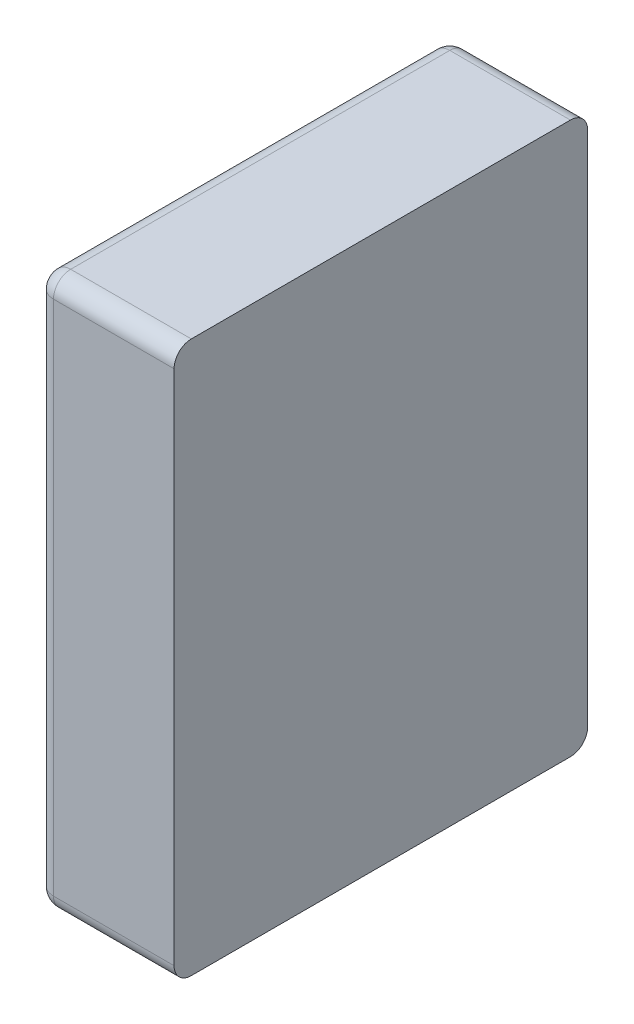
ISO-10303-21;
HEADER;
FILE_DESCRIPTION(('STEP AP214'),'2;1');
FILE_NAME('part.step','',(''),(''),'','','');
FILE_SCHEMA(('AUTOMOTIVE_DESIGN { 1 0 10303 214 1 1 1 1 }'));
ENDSEC;
DATA;
#1=APPLICATION_CONTEXT('core data for automotive mechanical design processes');
#2=APPLICATION_PROTOCOL_DEFINITION('international standard','automotive_design',2000,#1);
#3=PRODUCT_CONTEXT('',#1,'mechanical');
#4=PRODUCT('Part','Part','',(#3));
#5=PRODUCT_RELATED_PRODUCT_CATEGORY('part','',(#4));
#6=PRODUCT_DEFINITION_FORMATION('','',#4);
#7=PRODUCT_DEFINITION_CONTEXT('part definition',#1,'design');
#8=PRODUCT_DEFINITION('design','',#6,#7);
#9=PRODUCT_DEFINITION_SHAPE('','',#8);
#10=(LENGTH_UNIT() NAMED_UNIT(*) SI_UNIT(.MILLI.,.METRE.));
#11=(NAMED_UNIT(*) PLANE_ANGLE_UNIT() SI_UNIT($,.RADIAN.));
#12=(NAMED_UNIT(*) SI_UNIT($,.STERADIAN.) SOLID_ANGLE_UNIT());
#13=UNCERTAINTY_MEASURE_WITH_UNIT(LENGTH_MEASURE(1.E-05),#10,'distance_accuracy_value','');
#14=(GEOMETRIC_REPRESENTATION_CONTEXT(3) GLOBAL_UNCERTAINTY_ASSIGNED_CONTEXT((#13)) GLOBAL_UNIT_ASSIGNED_CONTEXT((#10,
#11,#12)) REPRESENTATION_CONTEXT('',''));
#15=CARTESIAN_POINT('',(0.,0.,0.));
#16=DIRECTION('',(0.,0.,1.));
#17=DIRECTION('',(1.,0.,0.));
#18=AXIS2_PLACEMENT_3D('',#15,#16,#17);
#19=CARTESIAN_POINT('',(-0.8,-0.4,0.3));
#20=DIRECTION('',(1.,0.,0.));
#21=DIRECTION('',(0.,0.,-1.));
#22=AXIS2_PLACEMENT_3D('',#19,#20,#21);
#23=PLANE('',#22);
#24=DIRECTION('',(0.,0.,1.));
#25=VECTOR('',#24,1.);
#26=CARTESIAN_POINT('',(-0.8,0.375,0.3));
#27=LINE('',#26,#25);
#28=CARTESIAN_POINT('',(-0.8,0.375,0.025));
#29=VERTEX_POINT('',#28);
#30=CARTESIAN_POINT('',(-0.8,0.375,0.575));
#31=VERTEX_POINT('',#30);
#32=EDGE_CURVE('E106',#29,#31,#27,.T.);
#33=ORIENTED_EDGE('',*,*,#32,.F.);
#34=DIRECTION('',(0.,-1.,0.));
#35=VECTOR('',#34,1.);
#36=CARTESIAN_POINT('',(-0.8,-0.4,0.025));
#37=LINE('',#36,#35);
#38=CARTESIAN_POINT('',(-0.8,-0.375,0.025));
#39=VERTEX_POINT('',#38);
#40=EDGE_CURVE('E101',#39,#29,#37,.F.);
#41=ORIENTED_EDGE('',*,*,#40,.F.);
#42=DIRECTION('',(0.,0.,-1.));
#43=VECTOR('',#42,1.);
#44=CARTESIAN_POINT('',(-0.8,-0.375,0.3));
#45=LINE('',#44,#43);
#46=CARTESIAN_POINT('',(-0.8,-0.375,0.575));
#47=VERTEX_POINT('',#46);
#48=EDGE_CURVE('E104',#47,#39,#45,.T.);
#49=ORIENTED_EDGE('',*,*,#48,.F.);
#50=DIRECTION('',(0.,-1.,0.));
#51=VECTOR('',#50,1.);
#52=CARTESIAN_POINT('',(-0.8,-0.4,0.575));
#53=LINE('',#52,#51);
#54=EDGE_CURVE('E166',#31,#47,#53,.T.);
#55=ORIENTED_EDGE('',*,*,#54,.F.);
#56=EDGE_LOOP('',(#33,#41,#49,#55));
#57=FACE_BOUND('',#56,.T.);
#58=ADVANCED_FACE('F17',(#57),#23,.F.);
#59=CARTESIAN_POINT('',(-0.775,0.375,0.025));
#60=DIRECTION('',(1.,0.,0.));
#61=DIRECTION('',(0.,1.,0.));
#62=AXIS2_PLACEMENT_3D('',#59,#60,#61);
#63=SPHERICAL_SURFACE('',#62,0.025);
#64=CARTESIAN_POINT('',(-0.775,0.375,0.025));
#65=DIRECTION('',(0.,-1.,0.));
#66=DIRECTION('',(0.,0.,-1.));
#67=AXIS2_PLACEMENT_3D('',#64,#65,#66);
#68=CIRCLE('',#67,0.025);
#69=CARTESIAN_POINT('',(-0.775,0.375,0.));
#70=VERTEX_POINT('',#69);
#71=EDGE_CURVE('E109',#29,#70,#68,.T.);
#72=ORIENTED_EDGE('',*,*,#71,.F.);
#73=CARTESIAN_POINT('',(-0.775,0.375,0.025));
#74=DIRECTION('',(0.,0.,1.));
#75=DIRECTION('',(1.,0.,0.));
#76=AXIS2_PLACEMENT_3D('',#73,#74,#75);
#77=CIRCLE('',#76,0.025);
#78=CARTESIAN_POINT('',(-0.775,0.4,0.025));
#79=VERTEX_POINT('',#78);
#80=EDGE_CURVE('E163',#79,#29,#77,.T.);
#81=ORIENTED_EDGE('',*,*,#80,.F.);
#82=CARTESIAN_POINT('',(-0.775,0.375,0.025));
#83=DIRECTION('',(-1.,0.,0.));
#84=DIRECTION('',(0.,0.,1.));
#85=AXIS2_PLACEMENT_3D('',#82,#83,#84);
#86=CIRCLE('',#85,0.025);
#87=EDGE_CURVE('E162',#70,#79,#86,.F.);
#88=ORIENTED_EDGE('',*,*,#87,.F.);
#89=EDGE_LOOP('',(#72,#81,#88));
#90=FACE_BOUND('',#89,.T.);
#91=ADVANCED_FACE('F152',(#90),#63,.T.);
#92=CARTESIAN_POINT('',(-0.775,-0.4,0.025));
#93=DIRECTION('',(0.,-1.,0.));
#94=DIRECTION('',(0.,0.,-1.));
#95=AXIS2_PLACEMENT_3D('',#92,#93,#94);
#96=CYLINDRICAL_SURFACE('',#95,0.025);
#97=ORIENTED_EDGE('',*,*,#71,.T.);
#98=DIRECTION('',(0.,1.,0.));
#99=VECTOR('',#98,1.);
#100=CARTESIAN_POINT('',(-0.775,-0.4,0.));
#101=LINE('',#100,#99);
#102=CARTESIAN_POINT('',(-0.775,-0.375,0.));
#103=VERTEX_POINT('',#102);
#104=EDGE_CURVE('E115',#70,#103,#101,.F.);
#105=ORIENTED_EDGE('',*,*,#104,.T.);
#106=CARTESIAN_POINT('',(-0.775,-0.375,0.025));
#107=DIRECTION('',(0.,1.,0.));
#108=DIRECTION('',(1.,0.,0.));
#109=AXIS2_PLACEMENT_3D('',#106,#107,#108);
#110=CIRCLE('',#109,0.025);
#111=EDGE_CURVE('E112',#39,#103,#110,.F.);
#112=ORIENTED_EDGE('',*,*,#111,.F.);
#113=ORIENTED_EDGE('',*,*,#40,.T.);
#114=EDGE_LOOP('',(#97,#105,#112,#113));
#115=FACE_BOUND('',#114,.T.);
#116=ADVANCED_FACE('F113',(#115),#96,.T.);
#117=CARTESIAN_POINT('',(-0.775,-0.375,0.025));
#118=DIRECTION('',(1.,0.,0.));
#119=DIRECTION('',(0.,1.,0.));
#120=AXIS2_PLACEMENT_3D('',#117,#118,#119);
#121=SPHERICAL_SURFACE('',#120,0.025);
#122=CARTESIAN_POINT('',(-0.775,-0.375,0.025));
#123=DIRECTION('',(0.,0.,-1.));
#124=DIRECTION('',(-1.,0.,0.));
#125=AXIS2_PLACEMENT_3D('',#122,#123,#124);
#126=CIRCLE('',#125,0.025);
#127=CARTESIAN_POINT('',(-0.775,-0.4,0.025));
#128=VERTEX_POINT('',#127);
#129=EDGE_CURVE('E121',#39,#128,#126,.F.);
#130=ORIENTED_EDGE('',*,*,#129,.F.);
#131=ORIENTED_EDGE('',*,*,#111,.T.);
#132=CARTESIAN_POINT('',(-0.775,-0.375,0.025));
#133=DIRECTION('',(1.,0.,0.));
#134=DIRECTION('',(0.,0.,-1.));
#135=AXIS2_PLACEMENT_3D('',#132,#133,#134);
#136=CIRCLE('',#135,0.025);
#137=EDGE_CURVE('E131',#128,#103,#136,.T.);
#138=ORIENTED_EDGE('',*,*,#137,.F.);
#139=EDGE_LOOP('',(#130,#131,#138));
#140=FACE_BOUND('',#139,.T.);
#141=ADVANCED_FACE('F130',(#140),#121,.T.);
#142=CARTESIAN_POINT('',(-0.775,-0.375,0.3));
#143=DIRECTION('',(0.,0.,-1.));
#144=DIRECTION('',(-1.,0.,0.));
#145=AXIS2_PLACEMENT_3D('',#142,#143,#144);
#146=CYLINDRICAL_SURFACE('',#145,0.025);
#147=CARTESIAN_POINT('',(-0.775,-0.375,0.575));
#148=DIRECTION('',(0.,0.,-1.));
#149=DIRECTION('',(1.,0.,0.));
#150=AXIS2_PLACEMENT_3D('',#147,#148,#149);
#151=CIRCLE('',#150,0.025);
#152=CARTESIAN_POINT('',(-0.775,-0.4,0.575));
#153=VERTEX_POINT('',#152);
#154=EDGE_CURVE('E127',#47,#153,#151,.F.);
#155=ORIENTED_EDGE('',*,*,#154,.F.);
#156=ORIENTED_EDGE('',*,*,#48,.T.);
#157=ORIENTED_EDGE('',*,*,#129,.T.);
#158=DIRECTION('',(0.,0.,-1.));
#159=VECTOR('',#158,1.);
#160=CARTESIAN_POINT('',(-0.775,-0.4,0.3));
#161=LINE('',#160,#159);
#162=EDGE_CURVE('E220',#153,#128,#161,.T.);
#163=ORIENTED_EDGE('',*,*,#162,.F.);
#164=EDGE_LOOP('',(#155,#156,#157,#163));
#165=FACE_BOUND('',#164,.T.);
#166=ADVANCED_FACE('F124',(#165),#146,.T.);
#167=CARTESIAN_POINT('',(-0.775,-0.375,0.575));
#168=DIRECTION('',(1.,0.,0.));
#169=DIRECTION('',(0.,1.,0.));
#170=AXIS2_PLACEMENT_3D('',#167,#168,#169);
#171=SPHERICAL_SURFACE('',#170,0.025);
#172=CARTESIAN_POINT('',(-0.775,-0.375,0.575));
#173=DIRECTION('',(-1.,0.,0.));
#174=DIRECTION('',(0.,0.,1.));
#175=AXIS2_PLACEMENT_3D('',#172,#173,#174);
#176=CIRCLE('',#175,0.025);
#177=CARTESIAN_POINT('',(-0.775,-0.375,0.6));
#178=VERTEX_POINT('',#177);
#179=EDGE_CURVE('E215',#178,#153,#176,.F.);
#180=ORIENTED_EDGE('',*,*,#179,.F.);
#181=CARTESIAN_POINT('',(-0.775,-0.375,0.575));
#182=DIRECTION('',(0.,-1.,0.));
#183=DIRECTION('',(0.,0.,-1.));
#184=AXIS2_PLACEMENT_3D('',#181,#182,#183);
#185=CIRCLE('',#184,0.025);
#186=EDGE_CURVE('E169',#47,#178,#185,.F.);
#187=ORIENTED_EDGE('',*,*,#186,.F.);
#188=ORIENTED_EDGE('',*,*,#154,.T.);
#189=EDGE_LOOP('',(#180,#187,#188));
#190=FACE_BOUND('',#189,.T.);
#191=ADVANCED_FACE('F264',(#190),#171,.T.);
#192=CARTESIAN_POINT('',(-0.775,-0.4,0.575));
#193=DIRECTION('',(0.,-1.,0.));
#194=DIRECTION('',(0.,0.,-1.));
#195=AXIS2_PLACEMENT_3D('',#192,#193,#194);
#196=CYLINDRICAL_SURFACE('',#195,0.025);
#197=CARTESIAN_POINT('',(-0.775,0.375,0.575));
#198=DIRECTION('',(0.,-1.,0.));
#199=DIRECTION('',(1.,0.,0.));
#200=AXIS2_PLACEMENT_3D('',#197,#198,#199);
#201=CIRCLE('',#200,0.025);
#202=CARTESIAN_POINT('',(-0.775,0.375,0.6));
#203=VERTEX_POINT('',#202);
#204=EDGE_CURVE('E168',#31,#203,#201,.F.);
#205=ORIENTED_EDGE('',*,*,#204,.F.);
#206=ORIENTED_EDGE('',*,*,#54,.T.);
#207=ORIENTED_EDGE('',*,*,#186,.T.);
#208=DIRECTION('',(0.,1.,0.));
#209=VECTOR('',#208,1.);
#210=CARTESIAN_POINT('',(-0.775,-0.4,0.6));
#211=LINE('',#210,#209);
#212=EDGE_CURVE('E210',#178,#203,#211,.T.);
#213=ORIENTED_EDGE('',*,*,#212,.T.);
#214=EDGE_LOOP('',(#205,#206,#207,#213));
#215=FACE_BOUND('',#214,.T.);
#216=ADVANCED_FACE('F260',(#215),#196,.T.);
#217=CARTESIAN_POINT('',(-0.775,0.375,0.575));
#218=DIRECTION('',(1.,0.,0.));
#219=DIRECTION('',(0.,1.,0.));
#220=AXIS2_PLACEMENT_3D('',#217,#218,#219);
#221=SPHERICAL_SURFACE('',#220,0.025);
#222=CARTESIAN_POINT('',(-0.775,0.375,0.575));
#223=DIRECTION('',(1.,0.,0.));
#224=DIRECTION('',(0.,0.,-1.));
#225=AXIS2_PLACEMENT_3D('',#222,#223,#224);
#226=CIRCLE('',#225,0.025);
#227=CARTESIAN_POINT('',(-0.775,0.4,0.575));
#228=VERTEX_POINT('',#227);
#229=EDGE_CURVE('E204',#228,#203,#226,.T.);
#230=ORIENTED_EDGE('',*,*,#229,.F.);
#231=CARTESIAN_POINT('',(-0.775,0.375,0.575));
#232=DIRECTION('',(0.,0.,1.));
#233=DIRECTION('',(1.,0.,0.));
#234=AXIS2_PLACEMENT_3D('',#231,#232,#233);
#235=CIRCLE('',#234,0.025);
#236=EDGE_CURVE('E66',#31,#228,#235,.F.);
#237=ORIENTED_EDGE('',*,*,#236,.F.);
#238=ORIENTED_EDGE('',*,*,#204,.T.);
#239=EDGE_LOOP('',(#230,#237,#238));
#240=FACE_BOUND('',#239,.T.);
#241=ADVANCED_FACE('F255',(#240),#221,.T.);
#242=CARTESIAN_POINT('',(-0.775,0.375,0.3));
#243=DIRECTION('',(0.,0.,1.));
#244=DIRECTION('',(1.,0.,0.));
#245=AXIS2_PLACEMENT_3D('',#242,#243,#244);
#246=CYLINDRICAL_SURFACE('',#245,0.025);
#247=ORIENTED_EDGE('',*,*,#80,.T.);
#248=ORIENTED_EDGE('',*,*,#32,.T.);
#249=ORIENTED_EDGE('',*,*,#236,.T.);
#250=DIRECTION('',(0.,0.,-1.));
#251=VECTOR('',#250,1.);
#252=CARTESIAN_POINT('',(-0.775,0.4,0.3));
#253=LINE('',#252,#251);
#254=EDGE_CURVE('E192',#228,#79,#253,.T.);
#255=ORIENTED_EDGE('',*,*,#254,.T.);
#256=EDGE_LOOP('',(#247,#248,#249,#255));
#257=FACE_BOUND('',#256,.T.);
#258=ADVANCED_FACE('F259',(#257),#246,.T.);
#259=CARTESIAN_POINT('',(-0.7,0.375,0.025));
#260=DIRECTION('',(-1.,0.,0.));
#261=DIRECTION('',(0.,0.,1.));
#262=AXIS2_PLACEMENT_3D('',#259,#260,#261);
#263=CYLINDRICAL_SURFACE('',#262,0.025);
#264=ORIENTED_EDGE('',*,*,#87,.T.);
#265=DIRECTION('',(1.,0.,0.));
#266=VECTOR('',#265,1.);
#267=CARTESIAN_POINT('',(-0.4,0.4,0.025));
#268=LINE('',#267,#266);
#269=CARTESIAN_POINT('',(-0.6,0.4,0.025));
#270=VERTEX_POINT('',#269);
#271=EDGE_CURVE('E196',#79,#270,#268,.T.);
#272=ORIENTED_EDGE('',*,*,#271,.T.);
#273=CARTESIAN_POINT('',(-0.6,0.375,0.025));
#274=DIRECTION('',(-1.,0.,0.));
#275=DIRECTION('',(0.,0.,1.));
#276=AXIS2_PLACEMENT_3D('',#273,#274,#275);
#277=CIRCLE('',#276,0.025);
#278=CARTESIAN_POINT('',(-0.6,0.375,0.));
#279=VERTEX_POINT('',#278);
#280=EDGE_CURVE('E20',#270,#279,#277,.T.);
#281=ORIENTED_EDGE('',*,*,#280,.T.);
#282=DIRECTION('',(1.,0.,0.));
#283=VECTOR('',#282,1.);
#284=CARTESIAN_POINT('',(-0.7,0.375,0.));
#285=LINE('',#284,#283);
#286=EDGE_CURVE('E141',#279,#70,#285,.F.);
#287=ORIENTED_EDGE('',*,*,#286,.T.);
#288=EDGE_LOOP('',(#264,#272,#281,#287));
#289=FACE_BOUND('',#288,.T.);
#290=ADVANCED_FACE('F371',(#289),#263,.T.);
#291=CARTESIAN_POINT('',(-0.7,-0.4,0.));
#292=DIRECTION('',(0.,0.,1.));
#293=DIRECTION('',(1.,0.,0.));
#294=AXIS2_PLACEMENT_3D('',#291,#292,#293);
#295=PLANE('',#294);
#296=ORIENTED_EDGE('',*,*,#286,.F.);
#297=DIRECTION('',(0.,1.,0.));
#298=VECTOR('',#297,1.);
#299=CARTESIAN_POINT('',(-0.6,-0.4,0.));
#300=LINE('',#299,#298);
#301=CARTESIAN_POINT('',(-0.6,-0.375,0.));
#302=VERTEX_POINT('',#301);
#303=EDGE_CURVE('E184',#279,#302,#300,.F.);
#304=ORIENTED_EDGE('',*,*,#303,.T.);
#305=DIRECTION('',(1.,0.,0.));
#306=VECTOR('',#305,1.);
#307=CARTESIAN_POINT('',(-0.4,-0.375,0.));
#308=LINE('',#307,#306);
#309=EDGE_CURVE('E223',#103,#302,#308,.T.);
#310=ORIENTED_EDGE('',*,*,#309,.F.);
#311=ORIENTED_EDGE('',*,*,#104,.F.);
#312=EDGE_LOOP('',(#296,#304,#310,#311));
#313=FACE_BOUND('',#312,.T.);
#314=ADVANCED_FACE('F362',(#313),#295,.F.);
#315=CARTESIAN_POINT('',(-0.4,-0.375,0.025));
#316=DIRECTION('',(1.,0.,0.));
#317=DIRECTION('',(0.,0.,-1.));
#318=AXIS2_PLACEMENT_3D('',#315,#316,#317);
#319=CYLINDRICAL_SURFACE('',#318,0.025);
#320=ORIENTED_EDGE('',*,*,#137,.T.);
#321=ORIENTED_EDGE('',*,*,#309,.T.);
#322=CARTESIAN_POINT('',(-0.6,-0.375,0.025));
#323=DIRECTION('',(1.,0.,0.));
#324=DIRECTION('',(0.,0.,-1.));
#325=AXIS2_PLACEMENT_3D('',#322,#323,#324);
#326=CIRCLE('',#325,0.025);
#327=CARTESIAN_POINT('',(-0.6,-0.4,0.025));
#328=VERTEX_POINT('',#327);
#329=EDGE_CURVE('E182',#302,#328,#326,.F.);
#330=ORIENTED_EDGE('',*,*,#329,.T.);
#331=DIRECTION('',(1.,0.,0.));
#332=VECTOR('',#331,1.);
#333=CARTESIAN_POINT('',(-0.4,-0.4,0.025));
#334=LINE('',#333,#332);
#335=EDGE_CURVE('E218',#128,#328,#334,.T.);
#336=ORIENTED_EDGE('',*,*,#335,.F.);
#337=EDGE_LOOP('',(#320,#321,#330,#336));
#338=FACE_BOUND('',#337,.T.);
#339=ADVANCED_FACE('F276',(#338),#319,.T.);
#340=CARTESIAN_POINT('',(-0.4,-0.4,0.3));
#341=DIRECTION('',(0.,-1.,0.));
#342=DIRECTION('',(0.,0.,-1.));
#343=AXIS2_PLACEMENT_3D('',#340,#341,#342);
#344=PLANE('',#343);
#345=ORIENTED_EDGE('',*,*,#162,.T.);
#346=ORIENTED_EDGE('',*,*,#335,.T.);
#347=DIRECTION('',(0.,0.,1.));
#348=VECTOR('',#347,1.);
#349=CARTESIAN_POINT('',(-0.6,-0.4,0.499600058));
#350=LINE('',#349,#348);
#351=CARTESIAN_POINT('',(-0.6,-0.4,0.575));
#352=VERTEX_POINT('',#351);
#353=EDGE_CURVE('E181',#328,#352,#350,.T.);
#354=ORIENTED_EDGE('',*,*,#353,.T.);
#355=DIRECTION('',(-1.,0.,0.));
#356=VECTOR('',#355,1.);
#357=CARTESIAN_POINT('',(-0.4,-0.4,0.575));
#358=LINE('',#357,#356);
#359=EDGE_CURVE('E211',#153,#352,#358,.F.);
#360=ORIENTED_EDGE('',*,*,#359,.F.);
#361=EDGE_LOOP('',(#345,#346,#354,#360));
#362=FACE_BOUND('',#361,.T.);
#363=ADVANCED_FACE('F279',(#362),#344,.T.);
#364=CARTESIAN_POINT('',(-0.4,-0.375,0.575));
#365=DIRECTION('',(-1.,0.,0.));
#366=DIRECTION('',(0.,0.,1.));
#367=AXIS2_PLACEMENT_3D('',#364,#365,#366);
#368=CYLINDRICAL_SURFACE('',#367,0.025);
#369=ORIENTED_EDGE('',*,*,#179,.T.);
#370=ORIENTED_EDGE('',*,*,#359,.T.);
#371=CARTESIAN_POINT('',(-0.6,-0.375,0.575));
#372=DIRECTION('',(-1.,0.,0.));
#373=DIRECTION('',(0.,0.,1.));
#374=AXIS2_PLACEMENT_3D('',#371,#372,#373);
#375=CIRCLE('',#374,0.025);
#376=CARTESIAN_POINT('',(-0.6,-0.375,0.6));
#377=VERTEX_POINT('',#376);
#378=EDGE_CURVE('E179',#352,#377,#375,.T.);
#379=ORIENTED_EDGE('',*,*,#378,.T.);
#380=DIRECTION('',(-1.,0.,0.));
#381=VECTOR('',#380,1.);
#382=CARTESIAN_POINT('',(-0.7,-0.375,0.6));
#383=LINE('',#382,#381);
#384=EDGE_CURVE('E207',#377,#178,#383,.T.);
#385=ORIENTED_EDGE('',*,*,#384,.T.);
#386=EDGE_LOOP('',(#369,#370,#379,#385));
#387=FACE_BOUND('',#386,.T.);
#388=ADVANCED_FACE('F288',(#387),#368,.T.);
#389=CARTESIAN_POINT('',(-0.7,-0.4,0.6));
#390=DIRECTION('',(0.,0.,-1.));
#391=DIRECTION('',(-1.,0.,0.));
#392=AXIS2_PLACEMENT_3D('',#389,#390,#391);
#393=PLANE('',#392);
#394=DIRECTION('',(1.,0.,0.));
#395=VECTOR('',#394,1.);
#396=CARTESIAN_POINT('',(-0.7,0.375,0.6));
#397=LINE('',#396,#395);
#398=CARTESIAN_POINT('',(-0.6,0.375,0.6));
#399=VERTEX_POINT('',#398);
#400=EDGE_CURVE('E200',#203,#399,#397,.T.);
#401=ORIENTED_EDGE('',*,*,#400,.F.);
#402=ORIENTED_EDGE('',*,*,#212,.F.);
#403=ORIENTED_EDGE('',*,*,#384,.F.);
#404=DIRECTION('',(0.,1.,0.));
#405=VECTOR('',#404,1.);
#406=CARTESIAN_POINT('',(-0.6,-0.4,0.6));
#407=LINE('',#406,#405);
#408=EDGE_CURVE('E178',#377,#399,#407,.T.);
#409=ORIENTED_EDGE('',*,*,#408,.T.);
#410=EDGE_LOOP('',(#401,#402,#403,#409));
#411=FACE_BOUND('',#410,.T.);
#412=ADVANCED_FACE('F308',(#411),#393,.F.);
#413=CARTESIAN_POINT('',(-0.7,0.375,0.575));
#414=DIRECTION('',(1.,0.,0.));
#415=DIRECTION('',(0.,0.,-1.));
#416=AXIS2_PLACEMENT_3D('',#413,#414,#415);
#417=CYLINDRICAL_SURFACE('',#416,0.025);
#418=ORIENTED_EDGE('',*,*,#229,.T.);
#419=ORIENTED_EDGE('',*,*,#400,.T.);
#420=CARTESIAN_POINT('',(-0.6,0.375,0.575));
#421=DIRECTION('',(1.,0.,0.));
#422=DIRECTION('',(0.,0.,-1.));
#423=AXIS2_PLACEMENT_3D('',#420,#421,#422);
#424=CIRCLE('',#423,0.025);
#425=CARTESIAN_POINT('',(-0.6,0.4,0.575));
#426=VERTEX_POINT('',#425);
#427=EDGE_CURVE('E26',#399,#426,#424,.F.);
#428=ORIENTED_EDGE('',*,*,#427,.T.);
#429=DIRECTION('',(1.,0.,0.));
#430=VECTOR('',#429,1.);
#431=CARTESIAN_POINT('',(-0.4,0.4,0.575));
#432=LINE('',#431,#430);
#433=EDGE_CURVE('E34',#426,#228,#432,.F.);
#434=ORIENTED_EDGE('',*,*,#433,.T.);
#435=EDGE_LOOP('',(#418,#419,#428,#434));
#436=FACE_BOUND('',#435,.T.);
#437=ADVANCED_FACE('F306',(#436),#417,.T.);
#438=CARTESIAN_POINT('',(-0.4,0.4,0.3));
#439=DIRECTION('',(0.,-1.,0.));
#440=DIRECTION('',(0.,0.,-1.));
#441=AXIS2_PLACEMENT_3D('',#438,#439,#440);
#442=PLANE('',#441);
#443=ORIENTED_EDGE('',*,*,#433,.F.);
#444=DIRECTION('',(0.,0.,1.));
#445=VECTOR('',#444,1.);
#446=CARTESIAN_POINT('',(-0.6,0.4,0.499600058));
#447=LINE('',#446,#445);
#448=EDGE_CURVE('E11',#426,#270,#447,.F.);
#449=ORIENTED_EDGE('',*,*,#448,.T.);
#450=ORIENTED_EDGE('',*,*,#271,.F.);
#451=ORIENTED_EDGE('',*,*,#254,.F.);
#452=EDGE_LOOP('',(#443,#449,#450,#451));
#453=FACE_BOUND('',#452,.T.);
#454=ADVANCED_FACE('F305',(#453),#442,.F.);
#455=CARTESIAN_POINT('',(-0.6,-0.4,0.499600058));
#456=DIRECTION('',(-1.,0.,0.));
#457=DIRECTION('',(0.,0.,1.));
#458=AXIS2_PLACEMENT_3D('',#455,#456,#457);
#459=PLANE('',#458);
#460=ORIENTED_EDGE('',*,*,#427,.F.);
#461=ORIENTED_EDGE('',*,*,#408,.F.);
#462=ORIENTED_EDGE('',*,*,#378,.F.);
#463=ORIENTED_EDGE('',*,*,#353,.F.);
#464=ORIENTED_EDGE('',*,*,#329,.F.);
#465=ORIENTED_EDGE('',*,*,#303,.F.);
#466=ORIENTED_EDGE('',*,*,#280,.F.);
#467=ORIENTED_EDGE('',*,*,#448,.F.);
#468=EDGE_LOOP('',(#460,#461,#462,#463,#464,#465,#466,#467));
#469=FACE_BOUND('',#468,.T.);
#470=ADVANCED_FACE('F283',(#469),#459,.F.);
#471=CLOSED_SHELL('',(#58,#91,#116,#141,#166,#191,#216,#241,#258,#290,#314,#339,#363,#388,#412,
#437,#454,#470));
#472=MANIFOLD_SOLID_BREP('B1',#471);
#473=ADVANCED_BREP_SHAPE_REPRESENTATION('',(#18,#472),#14);
#474=SHAPE_DEFINITION_REPRESENTATION(#9,#473);
ENDSEC;
END-ISO-10303-21;
